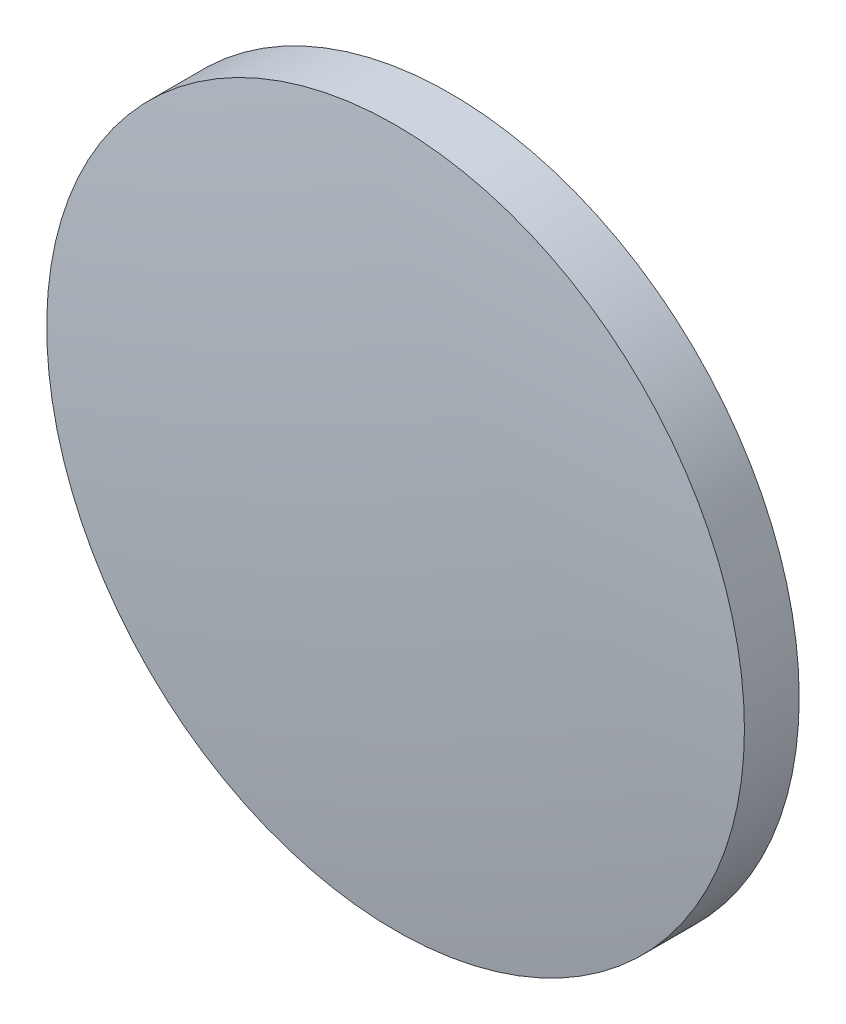
ISO-10303-21;
HEADER;
FILE_DESCRIPTION(('STEP AP214'),'2;1');
FILE_NAME('part.step','',(''),(''),'','','');
FILE_SCHEMA(('AUTOMOTIVE_DESIGN { 1 0 10303 214 1 1 1 1 }'));
ENDSEC;
DATA;
#1=APPLICATION_CONTEXT('core data for automotive mechanical design processes');
#2=APPLICATION_PROTOCOL_DEFINITION('international standard','automotive_design',2000,#1);
#3=PRODUCT_CONTEXT('',#1,'mechanical');
#4=PRODUCT('Part','Part','',(#3));
#5=PRODUCT_RELATED_PRODUCT_CATEGORY('part','',(#4));
#6=PRODUCT_DEFINITION_FORMATION('','',#4);
#7=PRODUCT_DEFINITION_CONTEXT('part definition',#1,'design');
#8=PRODUCT_DEFINITION('design','',#6,#7);
#9=PRODUCT_DEFINITION_SHAPE('','',#8);
#10=(LENGTH_UNIT() NAMED_UNIT(*) SI_UNIT(.MILLI.,.METRE.));
#11=(NAMED_UNIT(*) PLANE_ANGLE_UNIT() SI_UNIT($,.RADIAN.));
#12=(NAMED_UNIT(*) SI_UNIT($,.STERADIAN.) SOLID_ANGLE_UNIT());
#13=UNCERTAINTY_MEASURE_WITH_UNIT(LENGTH_MEASURE(1.E-05),#10,'distance_accuracy_value','');
#14=(GEOMETRIC_REPRESENTATION_CONTEXT(3) GLOBAL_UNCERTAINTY_ASSIGNED_CONTEXT((#13)) GLOBAL_UNIT_ASSIGNED_CONTEXT((#10,
#11,#12)) REPRESENTATION_CONTEXT('',''));
#15=CARTESIAN_POINT('',(0.,0.,0.));
#16=DIRECTION('',(0.,0.,1.));
#17=DIRECTION('',(1.,0.,0.));
#18=AXIS2_PLACEMENT_3D('',#15,#16,#17);
#19=CARTESIAN_POINT('',(0.,0.,-101.62));
#20=DIRECTION('',(0.,0.,1.));
#21=DIRECTION('',(0.,1.,0.));
#22=AXIS2_PLACEMENT_3D('',#19,#20,#21);
#23=SPHERICAL_SURFACE('',#22,103.01);
#24=CARTESIAN_POINT('',(0.,0.,0.60411701746317));
#25=DIRECTION('',(0.,0.,1.));
#26=DIRECTION('',(1.,0.,0.));
#27=AXIS2_PLACEMENT_3D('',#24,#25,#26);
#28=CIRCLE('',#27,12.7);
#29=CARTESIAN_POINT('',(12.7,0.,0.60411701746317));
#30=VERTEX_POINT('',#29);
#31=EDGE_CURVE('E8',#30,#30,#28,.T.);
#32=ORIENTED_EDGE('',*,*,#31,.T.);
#33=EDGE_LOOP('',(#32));
#34=FACE_BOUND('',#33,.T.);
#35=ADVANCED_FACE('F12',(#34),#23,.T.);
#36=CARTESIAN_POINT('',(0.,0.,4.30813204540037));
#37=DIRECTION('',(0.,0.,1.));
#38=DIRECTION('',(1.,0.,0.));
#39=AXIS2_PLACEMENT_3D('',#36,#37,#38);
#40=CYLINDRICAL_SURFACE('',#39,12.7);
#41=ORIENTED_EDGE('',*,*,#31,.F.);
#42=EDGE_LOOP('',(#41));
#43=FACE_BOUND('',#42,.T.);
#44=CARTESIAN_POINT('',(0.,0.,-1.39));
#45=DIRECTION('',(0.,0.,1.));
#46=DIRECTION('',(1.,0.,0.));
#47=AXIS2_PLACEMENT_3D('',#44,#45,#46);
#48=CIRCLE('',#47,12.7);
#49=CARTESIAN_POINT('',(12.7,0.,-1.39));
#50=VERTEX_POINT('',#49);
#51=EDGE_CURVE('E18',#50,#50,#48,.T.);
#52=ORIENTED_EDGE('',*,*,#51,.T.);
#53=EDGE_LOOP('',(#52));
#54=FACE_BOUND('',#53,.T.);
#55=ADVANCED_FACE('F24',(#43,#54),#40,.T.);
#56=CARTESIAN_POINT('',(0.,0.,-1.39));
#57=DIRECTION('',(0.,0.,1.));
#58=DIRECTION('',(1.,0.,0.));
#59=AXIS2_PLACEMENT_3D('',#56,#57,#58);
#60=PLANE('',#59);
#61=ORIENTED_EDGE('',*,*,#51,.F.);
#62=EDGE_LOOP('',(#61));
#63=FACE_BOUND('',#62,.T.);
#64=ADVANCED_FACE('F26',(#63),#60,.F.);
#65=CLOSED_SHELL('',(#35,#55,#64));
#66=MANIFOLD_SOLID_BREP('B1',#65);
#67=ADVANCED_BREP_SHAPE_REPRESENTATION('',(#18,#66),#14);
#68=SHAPE_DEFINITION_REPRESENTATION(#9,#67);
ENDSEC;
END-ISO-10303-21;
